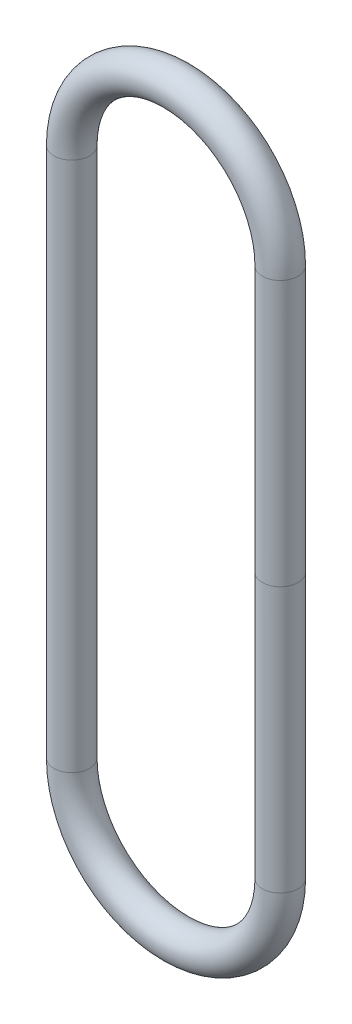
ISO-10303-21;
HEADER;
FILE_DESCRIPTION(('STEP AP214'),'2;1');
FILE_NAME('part.step','',(''),(''),'','','');
FILE_SCHEMA(('AUTOMOTIVE_DESIGN { 1 0 10303 214 1 1 1 1 }'));
ENDSEC;
DATA;
#1=APPLICATION_CONTEXT('core data for automotive mechanical design processes');
#2=APPLICATION_PROTOCOL_DEFINITION('international standard','automotive_design',2000,#1);
#3=PRODUCT_CONTEXT('',#1,'mechanical');
#4=PRODUCT('Part','Part','',(#3));
#5=PRODUCT_RELATED_PRODUCT_CATEGORY('part','',(#4));
#6=PRODUCT_DEFINITION_FORMATION('','',#4);
#7=PRODUCT_DEFINITION_CONTEXT('part definition',#1,'design');
#8=PRODUCT_DEFINITION('design','',#6,#7);
#9=PRODUCT_DEFINITION_SHAPE('','',#8);
#10=(LENGTH_UNIT() NAMED_UNIT(*) SI_UNIT(.MILLI.,.METRE.));
#11=(NAMED_UNIT(*) PLANE_ANGLE_UNIT() SI_UNIT($,.RADIAN.));
#12=(NAMED_UNIT(*) SI_UNIT($,.STERADIAN.) SOLID_ANGLE_UNIT());
#13=UNCERTAINTY_MEASURE_WITH_UNIT(LENGTH_MEASURE(1.E-05),#10,'distance_accuracy_value','');
#14=(GEOMETRIC_REPRESENTATION_CONTEXT(3) GLOBAL_UNCERTAINTY_ASSIGNED_CONTEXT((#13)) GLOBAL_UNIT_ASSIGNED_CONTEXT((#10,
#11,#12)) REPRESENTATION_CONTEXT('',''));
#15=CARTESIAN_POINT('',(0.,0.,0.));
#16=DIRECTION('',(0.,0.,1.));
#17=DIRECTION('',(1.,0.,0.));
#18=AXIS2_PLACEMENT_3D('',#15,#16,#17);
#19=CARTESIAN_POINT('',(5.17849999999998,0.,0.));
#20=DIRECTION('',(0.,-1.,0.));
#21=DIRECTION('',(1.,0.,0.));
#22=AXIS2_PLACEMENT_3D('',#19,#20,#21);
#23=CYLINDRICAL_SURFACE('',#22,0.889);
#24=CARTESIAN_POINT('',(5.17849999999999,-13.175,0.));
#25=DIRECTION('',(0.,1.,0.));
#26=DIRECTION('',(0.,0.,1.));
#27=AXIS2_PLACEMENT_3D('',#24,#25,#26);
#28=CIRCLE('',#27,0.889);
#29=CARTESIAN_POINT('',(6.06749999999999,-13.175,0.));
#30=VERTEX_POINT('',#29);
#31=EDGE_CURVE('E48',#30,#30,#28,.T.);
#32=ORIENTED_EDGE('',*,*,#31,.T.);
#33=EDGE_LOOP('',(#32));
#34=FACE_BOUND('',#33,.T.);
#35=CARTESIAN_POINT('',(5.17849999999998,0.,0.));
#36=DIRECTION('',(0.,1.,0.));
#37=DIRECTION('',(0.,0.,1.));
#38=AXIS2_PLACEMENT_3D('',#35,#36,#37);
#39=CIRCLE('',#38,0.889);
#40=CARTESIAN_POINT('',(5.17849999999998,0.,0.889));
#41=VERTEX_POINT('',#40);
#42=EDGE_CURVE('E53',#41,#41,#39,.T.);
#43=ORIENTED_EDGE('',*,*,#42,.F.);
#44=EDGE_LOOP('',(#43));
#45=FACE_BOUND('',#44,.T.);
#46=ADVANCED_FACE('F33',(#34,#45),#23,.T.);
#47=CARTESIAN_POINT('',(0.,-13.175,0.));
#48=DIRECTION('',(0.,0.,-1.));
#49=DIRECTION('',(-1.,0.,0.));
#50=AXIS2_PLACEMENT_3D('',#47,#48,#49);
#51=TOROIDAL_SURFACE('',#50,5.17849999999999,0.889);
#52=CARTESIAN_POINT('',(-5.17849999999998,-13.175,0.));
#53=DIRECTION('',(0.,-1.,0.));
#54=DIRECTION('',(0.,0.,1.));
#55=AXIS2_PLACEMENT_3D('',#52,#53,#54);
#56=CIRCLE('',#55,0.889);
#57=CARTESIAN_POINT('',(-6.06749999999998,-13.175,0.));
#58=VERTEX_POINT('',#57);
#59=EDGE_CURVE('E44',#58,#58,#56,.T.);
#60=CARTESIAN_POINT('',(0.,-13.175,0.));
#61=DIRECTION('',(0.,0.,-1.));
#62=DIRECTION('',(-1.,0.,0.));
#63=AXIS2_PLACEMENT_3D('',#60,#61,#62);
#64=CIRCLE('',#63,6.06749999999999);
#65=EDGE_CURVE('',#30,#58,#64,.T.);
#66=ORIENTED_EDGE('',*,*,#31,.F.);
#67=ORIENTED_EDGE('',*,*,#59,.T.);
#68=ORIENTED_EDGE('',*,*,#65,.T.);
#69=ORIENTED_EDGE('',*,*,#65,.F.);
#70=EDGE_LOOP('',(#66,#68,#67,#69));
#71=FACE_BOUND('',#70,.T.);
#72=ADVANCED_FACE('F60',(#71),#51,.T.);
#73=CARTESIAN_POINT('',(-5.17849999999999,-13.175,0.));
#74=DIRECTION('',(0.,1.,0.));
#75=DIRECTION('',(-1.,0.,0.));
#76=AXIS2_PLACEMENT_3D('',#73,#74,#75);
#77=CYLINDRICAL_SURFACE('',#76,0.889);
#78=CARTESIAN_POINT('',(-5.17849999999999,13.175,0.));
#79=DIRECTION('',(0.,-1.,0.));
#80=DIRECTION('',(0.,0.,1.));
#81=AXIS2_PLACEMENT_3D('',#78,#79,#80);
#82=CIRCLE('',#81,0.889);
#83=CARTESIAN_POINT('',(-6.06749999999998,13.175,0.));
#84=VERTEX_POINT('',#83);
#85=EDGE_CURVE('E40',#84,#84,#82,.T.);
#86=ORIENTED_EDGE('',*,*,#85,.T.);
#87=EDGE_LOOP('',(#86));
#88=FACE_BOUND('',#87,.T.);
#89=ORIENTED_EDGE('',*,*,#59,.F.);
#90=EDGE_LOOP('',(#89));
#91=FACE_BOUND('',#90,.T.);
#92=ADVANCED_FACE('F66',(#88,#91),#77,.T.);
#93=CARTESIAN_POINT('',(0.,13.175,0.));
#94=DIRECTION('',(0.,0.,-1.));
#95=DIRECTION('',(-1.,0.,0.));
#96=AXIS2_PLACEMENT_3D('',#93,#94,#95);
#97=TOROIDAL_SURFACE('',#96,5.17849999999999,0.889);
#98=CARTESIAN_POINT('',(5.17849999999999,13.175,0.));
#99=DIRECTION('',(0.,1.,0.));
#100=DIRECTION('',(0.,0.,1.));
#101=AXIS2_PLACEMENT_3D('',#98,#99,#100);
#102=CIRCLE('',#101,0.889);
#103=CARTESIAN_POINT('',(6.06749999999999,13.175,0.));
#104=VERTEX_POINT('',#103);
#105=EDGE_CURVE('E10',#104,#104,#102,.T.);
#106=CARTESIAN_POINT('',(0.,13.175,0.));
#107=DIRECTION('',(0.,0.,-1.));
#108=DIRECTION('',(-1.,0.,0.));
#109=AXIS2_PLACEMENT_3D('',#106,#107,#108);
#110=CIRCLE('',#109,6.06749999999999);
#111=EDGE_CURVE('',#84,#104,#110,.T.);
#112=ORIENTED_EDGE('',*,*,#85,.F.);
#113=ORIENTED_EDGE('',*,*,#105,.T.);
#114=ORIENTED_EDGE('',*,*,#111,.T.);
#115=ORIENTED_EDGE('',*,*,#111,.F.);
#116=EDGE_LOOP('',(#112,#114,#113,#115));
#117=FACE_BOUND('',#116,.T.);
#118=ADVANCED_FACE('F71',(#117),#97,.T.);
#119=CARTESIAN_POINT('',(5.17849999999998,13.175,0.));
#120=DIRECTION('',(0.,-1.,0.));
#121=DIRECTION('',(1.,0.,0.));
#122=AXIS2_PLACEMENT_3D('',#119,#120,#121);
#123=CYLINDRICAL_SURFACE('',#122,0.889);
#124=ORIENTED_EDGE('',*,*,#42,.T.);
#125=EDGE_LOOP('',(#124));
#126=FACE_BOUND('',#125,.T.);
#127=ORIENTED_EDGE('',*,*,#105,.F.);
#128=EDGE_LOOP('',(#127));
#129=FACE_BOUND('',#128,.T.);
#130=ADVANCED_FACE('F35',(#126,#129),#123,.T.);
#131=CLOSED_SHELL('',(#46,#72,#92,#118,#130));
#132=MANIFOLD_SOLID_BREP('B2',#131);
#133=ADVANCED_BREP_SHAPE_REPRESENTATION('',(#18,#132),#14);
#134=SHAPE_DEFINITION_REPRESENTATION(#9,#133);
ENDSEC;
END-ISO-10303-21;
